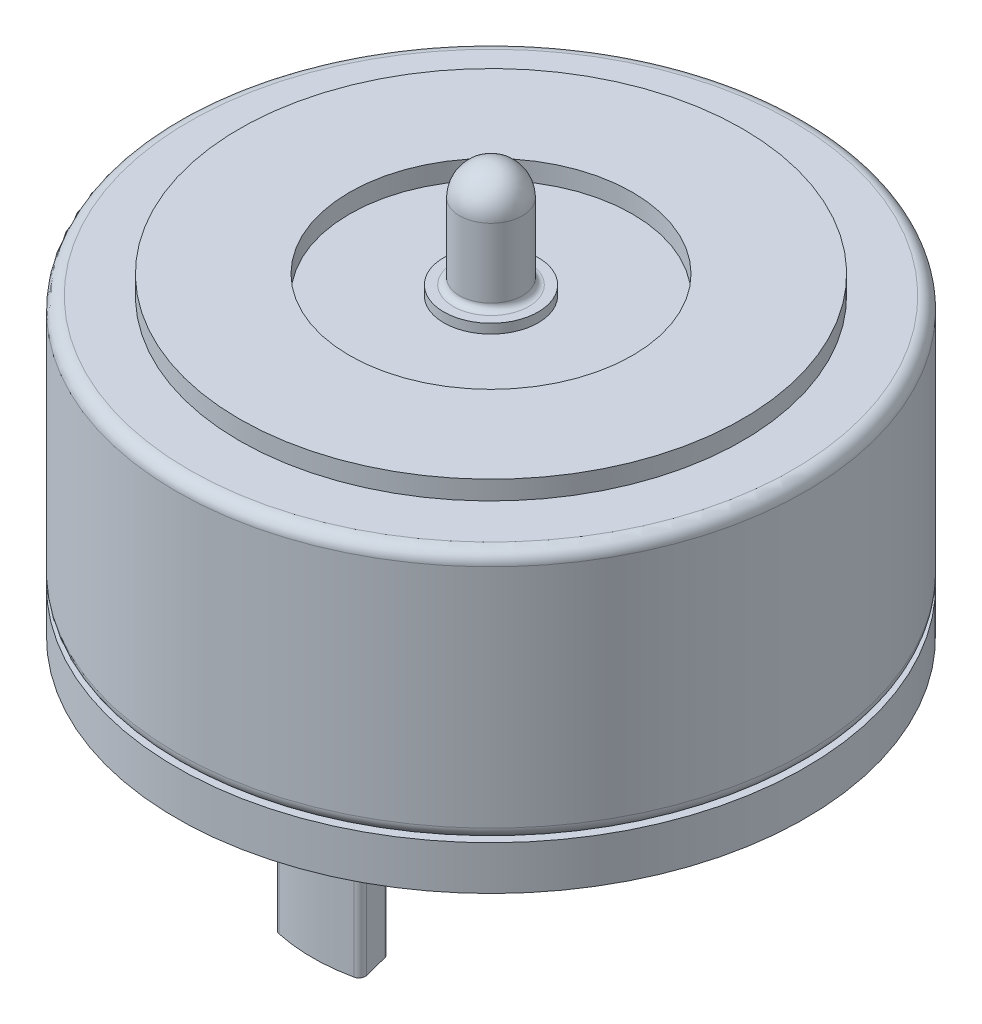
ISO-10303-21;
HEADER;
FILE_DESCRIPTION(('STEP AP214'),'2;1');
FILE_NAME('part.step','',(''),(''),'','','');
FILE_SCHEMA(('AUTOMOTIVE_DESIGN { 1 0 10303 214 1 1 1 1 }'));
ENDSEC;
DATA;
#1=APPLICATION_CONTEXT('core data for automotive mechanical design processes');
#2=APPLICATION_PROTOCOL_DEFINITION('international standard','automotive_design',2000,#1);
#3=PRODUCT_CONTEXT('',#1,'mechanical');
#4=PRODUCT('Part','Part','',(#3));
#5=PRODUCT_RELATED_PRODUCT_CATEGORY('part','',(#4));
#6=PRODUCT_DEFINITION_FORMATION('','',#4);
#7=PRODUCT_DEFINITION_CONTEXT('part definition',#1,'design');
#8=PRODUCT_DEFINITION('design','',#6,#7);
#9=PRODUCT_DEFINITION_SHAPE('','',#8);
#10=(LENGTH_UNIT() NAMED_UNIT(*) SI_UNIT(.MILLI.,.METRE.));
#11=(NAMED_UNIT(*) PLANE_ANGLE_UNIT() SI_UNIT($,.RADIAN.));
#12=(NAMED_UNIT(*) SI_UNIT($,.STERADIAN.) SOLID_ANGLE_UNIT());
#13=UNCERTAINTY_MEASURE_WITH_UNIT(LENGTH_MEASURE(1.E-05),#10,'distance_accuracy_value','');
#14=(GEOMETRIC_REPRESENTATION_CONTEXT(3) GLOBAL_UNCERTAINTY_ASSIGNED_CONTEXT((#13)) GLOBAL_UNIT_ASSIGNED_CONTEXT((#10,
#11,#12)) REPRESENTATION_CONTEXT('',''));
#15=CARTESIAN_POINT('',(0.,0.,0.));
#16=DIRECTION('',(0.,0.,1.));
#17=DIRECTION('',(1.,0.,0.));
#18=AXIS2_PLACEMENT_3D('',#15,#16,#17);
#19=CARTESIAN_POINT('',(0.,-0.7,0.));
#20=DIRECTION('',(0.,-1.,0.));
#21=DIRECTION('',(0.,0.,-1.));
#22=AXIS2_PLACEMENT_3D('',#19,#20,#21);
#23=PLANE('',#22);
#24=CARTESIAN_POINT('',(0.,-0.7,0.));
#25=DIRECTION('',(0.,-1.,0.));
#26=DIRECTION('',(0.,0.,-1.));
#27=AXIS2_PLACEMENT_3D('',#24,#25,#26);
#28=CIRCLE('',#27,0.3);
#29=CARTESIAN_POINT('',(0.,-0.7,-0.3));
#30=VERTEX_POINT('',#29);
#31=EDGE_CURVE('E459',#30,#30,#28,.T.);
#32=ORIENTED_EDGE('',*,*,#31,.F.);
#33=EDGE_LOOP('',(#32));
#34=FACE_BOUND('',#33,.T.);
#35=CARTESIAN_POINT('',(0.,-0.7,0.));
#36=DIRECTION('',(0.,-1.,0.));
#37=DIRECTION('',(0.,0.,-1.));
#38=AXIS2_PLACEMENT_3D('',#35,#36,#37);
#39=CIRCLE('',#38,5.);
#40=CARTESIAN_POINT('',(0.,-0.7,-5.));
#41=VERTEX_POINT('',#40);
#42=EDGE_CURVE('E217',#41,#41,#39,.T.);
#43=ORIENTED_EDGE('',*,*,#42,.T.);
#44=EDGE_LOOP('',(#43));
#45=FACE_BOUND('',#44,.T.);
#46=DIRECTION('',(0.246478873239437,0.,-0.969148164651111));
#47=VECTOR('',#46,1.);
#48=CARTESIAN_POINT('',(-0.7,-0.7,2.75238078760916));
#49=LINE('',#48,#47);
#50=CARTESIAN_POINT('',(-0.674902183835909,-0.7,2.65369686329345));
#51=VERTEX_POINT('',#50);
#52=CARTESIAN_POINT('',(-0.576233658441787,-0.7,2.26573492952702));
#53=VERTEX_POINT('',#52);
#54=EDGE_CURVE('E209',#51,#53,#49,.T.);
#55=ORIENTED_EDGE('',*,*,#54,.F.);
#56=CARTESIAN_POINT('',(-0.577987367370798,-0.7,2.6783447506174));
#57=DIRECTION('',(0.,-1.,0.));
#58=DIRECTION('',(0.,0.,-1.));
#59=AXIS2_PLACEMENT_3D('',#56,#57,#58);
#60=CIRCLE('',#59,0.1);
#61=CARTESIAN_POINT('',(-0.599081796836886,-0.7,2.77609455903409));
#62=VERTEX_POINT('',#61);
#63=EDGE_CURVE('E49',#51,#62,#60,.F.);
#64=ORIENTED_EDGE('',*,*,#63,.T.);
#65=CARTESIAN_POINT('',(0.,-0.7,0.));
#66=DIRECTION('',(0.,-1.,0.));
#67=DIRECTION('',(0.,0.,-1.));
#68=AXIS2_PLACEMENT_3D('',#65,#66,#67);
#69=CIRCLE('',#68,2.84);
#70=CARTESIAN_POINT('',(0.599081796836885,-0.7,2.77609455903409));
#71=VERTEX_POINT('',#70);
#72=EDGE_CURVE('E206',#71,#62,#69,.T.);
#73=ORIENTED_EDGE('',*,*,#72,.F.);
#74=CARTESIAN_POINT('',(0.577987367370797,-0.7,2.6783447506174));
#75=DIRECTION('',(0.,-1.,0.));
#76=DIRECTION('',(0.,0.,-1.));
#77=AXIS2_PLACEMENT_3D('',#74,#75,#76);
#78=CIRCLE('',#77,0.1);
#79=CARTESIAN_POINT('',(0.674902183835909,-0.7,2.65369686329345));
#80=VERTEX_POINT('',#79);
#81=EDGE_CURVE('E313',#71,#80,#78,.F.);
#82=ORIENTED_EDGE('',*,*,#81,.T.);
#83=DIRECTION('',(0.246478873239436,0.,0.969148164651111));
#84=VECTOR('',#83,1.);
#85=CARTESIAN_POINT('',(0.7,-0.7,2.75238078760916));
#86=LINE('',#85,#84);
#87=CARTESIAN_POINT('',(0.576233658441787,-0.7,2.26573492952702));
#88=VERTEX_POINT('',#87);
#89=EDGE_CURVE('E196',#88,#80,#86,.T.);
#90=ORIENTED_EDGE('',*,*,#89,.F.);
#91=CARTESIAN_POINT('',(0.479318841976676,-0.7,2.29038281685096));
#92=DIRECTION('',(0.,-1.,0.));
#93=DIRECTION('',(0.,0.,-1.));
#94=AXIS2_PLACEMENT_3D('',#91,#92,#93);
#95=CIRCLE('',#94,0.1);
#96=CARTESIAN_POINT('',(0.458835130781091,-0.7,2.19250320929323));
#97=VERTEX_POINT('',#96);
#98=EDGE_CURVE('E315',#88,#97,#95,.F.);
#99=ORIENTED_EDGE('',*,*,#98,.T.);
#100=CARTESIAN_POINT('',(0.,-0.7,0.));
#101=DIRECTION('',(0.,1.,0.));
#102=DIRECTION('',(0.,0.,-1.));
#103=AXIS2_PLACEMENT_3D('',#100,#101,#102);
#104=CIRCLE('',#103,2.24);
#105=CARTESIAN_POINT('',(-0.458835130781092,-0.7,2.19250320929323));
#106=VERTEX_POINT('',#105);
#107=EDGE_CURVE('E212',#106,#97,#104,.T.);
#108=ORIENTED_EDGE('',*,*,#107,.F.);
#109=CARTESIAN_POINT('',(-0.479318841976676,-0.7,2.29038281685096));
#110=DIRECTION('',(0.,-1.,0.));
#111=DIRECTION('',(0.,0.,-1.));
#112=AXIS2_PLACEMENT_3D('',#109,#110,#111);
#113=CIRCLE('',#112,0.1);
#114=EDGE_CURVE('E12',#106,#53,#113,.F.);
#115=ORIENTED_EDGE('',*,*,#114,.T.);
#116=EDGE_LOOP('',(#55,#64,#73,#82,#90,#99,#108,#115));
#117=FACE_BOUND('',#116,.T.);
#118=DIRECTION('',(-0.246478873239437,0.,0.969148164651111));
#119=VECTOR('',#118,1.);
#120=CARTESIAN_POINT('',(0.552112676056338,-0.7,-2.17089188881849));
#121=LINE('',#120,#119);
#122=CARTESIAN_POINT('',(0.674902183835909,-0.7,-2.65369686329345));
#123=VERTEX_POINT('',#122);
#124=CARTESIAN_POINT('',(0.576233658441787,-0.7,-2.26573492952702));
#125=VERTEX_POINT('',#124);
#126=EDGE_CURVE('E170',#123,#125,#121,.T.);
#127=ORIENTED_EDGE('',*,*,#126,.F.);
#128=CARTESIAN_POINT('',(0.577987367370798,-0.7,-2.6783447506174));
#129=DIRECTION('',(0.,-1.,0.));
#130=DIRECTION('',(0.,0.,-1.));
#131=AXIS2_PLACEMENT_3D('',#128,#129,#130);
#132=CIRCLE('',#131,0.1);
#133=CARTESIAN_POINT('',(0.599081796836885,-0.7,-2.77609455903409));
#134=VERTEX_POINT('',#133);
#135=EDGE_CURVE('E153',#123,#134,#132,.F.);
#136=ORIENTED_EDGE('',*,*,#135,.T.);
#137=CARTESIAN_POINT('',(0.,-0.7,0.));
#138=DIRECTION('',(0.,-1.,0.));
#139=DIRECTION('',(0.,0.,-1.));
#140=AXIS2_PLACEMENT_3D('',#137,#138,#139);
#141=CIRCLE('',#140,2.84);
#142=CARTESIAN_POINT('',(-0.599081796836885,-0.7,-2.77609455903409));
#143=VERTEX_POINT('',#142);
#144=EDGE_CURVE('E180',#143,#134,#141,.T.);
#145=ORIENTED_EDGE('',*,*,#144,.F.);
#146=CARTESIAN_POINT('',(-0.577987367370797,-0.7,-2.6783447506174));
#147=DIRECTION('',(0.,-1.,0.));
#148=DIRECTION('',(0.,0.,-1.));
#149=AXIS2_PLACEMENT_3D('',#146,#147,#148);
#150=CIRCLE('',#149,0.1);
#151=CARTESIAN_POINT('',(-0.674902183835908,-0.7,-2.65369686329346));
#152=VERTEX_POINT('',#151);
#153=EDGE_CURVE('E163',#143,#152,#150,.F.);
#154=ORIENTED_EDGE('',*,*,#153,.T.);
#155=DIRECTION('',(-0.246478873239436,0.,-0.969148164651112));
#156=VECTOR('',#155,1.);
#157=CARTESIAN_POINT('',(-0.552112676056337,-0.7,-2.17089188881849));
#158=LINE('',#157,#156);
#159=CARTESIAN_POINT('',(-0.576233658441786,-0.7,-2.26573492952702));
#160=VERTEX_POINT('',#159);
#161=EDGE_CURVE('E183',#160,#152,#158,.T.);
#162=ORIENTED_EDGE('',*,*,#161,.F.);
#163=CARTESIAN_POINT('',(-0.479318841976675,-0.7,-2.29038281685096));
#164=DIRECTION('',(0.,-1.,0.));
#165=DIRECTION('',(0.,0.,-1.));
#166=AXIS2_PLACEMENT_3D('',#163,#164,#165);
#167=CIRCLE('',#166,0.1);
#168=CARTESIAN_POINT('',(-0.458835130781091,-0.7,-2.19250320929323));
#169=VERTEX_POINT('',#168);
#170=EDGE_CURVE('E310',#160,#169,#167,.F.);
#171=ORIENTED_EDGE('',*,*,#170,.T.);
#172=CARTESIAN_POINT('',(0.,-0.7,0.));
#173=DIRECTION('',(0.,1.,0.));
#174=DIRECTION('',(0.,0.,-1.));
#175=AXIS2_PLACEMENT_3D('',#172,#173,#174);
#176=CIRCLE('',#175,2.24);
#177=CARTESIAN_POINT('',(0.458835130781091,-0.7,-2.19250320929323));
#178=VERTEX_POINT('',#177);
#179=EDGE_CURVE('E179',#178,#169,#176,.T.);
#180=ORIENTED_EDGE('',*,*,#179,.F.);
#181=CARTESIAN_POINT('',(0.479318841976676,-0.7,-2.29038281685096));
#182=DIRECTION('',(0.,-1.,0.));
#183=DIRECTION('',(0.,0.,-1.));
#184=AXIS2_PLACEMENT_3D('',#181,#182,#183);
#185=CIRCLE('',#184,0.1);
#186=EDGE_CURVE('E178',#178,#125,#185,.F.);
#187=ORIENTED_EDGE('',*,*,#186,.T.);
#188=EDGE_LOOP('',(#127,#136,#145,#154,#162,#171,#180,#187));
#189=FACE_BOUND('',#188,.T.);
#190=ADVANCED_FACE('F41',(#34,#45,#117,#189),#23,.T.);
#191=CARTESIAN_POINT('',(0.,4.3,0.));
#192=DIRECTION('',(0.,-1.,0.));
#193=DIRECTION('',(0.,0.,-1.));
#194=AXIS2_PLACEMENT_3D('',#191,#192,#193);
#195=CYLINDRICAL_SURFACE('',#194,5.);
#196=CARTESIAN_POINT('',(0.,0.2,0.));
#197=DIRECTION('',(0.,1.,0.));
#198=DIRECTION('',(0.,0.,1.));
#199=AXIS2_PLACEMENT_3D('',#196,#197,#198);
#200=CIRCLE('',#199,5.);
#201=CARTESIAN_POINT('',(0.,0.2,5.));
#202=VERTEX_POINT('',#201);
#203=EDGE_CURVE('E246',#202,#202,#200,.T.);
#204=ORIENTED_EDGE('',*,*,#203,.T.);
#205=EDGE_LOOP('',(#204));
#206=FACE_BOUND('',#205,.T.);
#207=CARTESIAN_POINT('',(0.,3.8,0.));
#208=DIRECTION('',(0.,1.,0.));
#209=DIRECTION('',(0.,0.,1.));
#210=AXIS2_PLACEMENT_3D('',#207,#208,#209);
#211=CIRCLE('',#210,5.);
#212=CARTESIAN_POINT('',(0.,3.8,5.));
#213=VERTEX_POINT('',#212);
#214=EDGE_CURVE('E243',#213,#213,#211,.F.);
#215=ORIENTED_EDGE('',*,*,#214,.T.);
#216=EDGE_LOOP('',(#215));
#217=FACE_BOUND('',#216,.T.);
#218=ADVANCED_FACE('F360',(#206,#217),#195,.T.);
#219=CARTESIAN_POINT('',(0.,4.,0.));
#220=DIRECTION('',(0.,1.,0.));
#221=DIRECTION('',(0.,0.,1.));
#222=AXIS2_PLACEMENT_3D('',#219,#220,#221);
#223=CYLINDRICAL_SURFACE('',#222,4.);
#224=CARTESIAN_POINT('',(0.,4.,0.));
#225=DIRECTION('',(0.,1.,0.));
#226=DIRECTION('',(0.,0.,1.));
#227=AXIS2_PLACEMENT_3D('',#224,#225,#226);
#228=CIRCLE('',#227,4.);
#229=CARTESIAN_POINT('',(0.,4.,4.));
#230=VERTEX_POINT('',#229);
#231=EDGE_CURVE('E235',#230,#230,#228,.T.);
#232=ORIENTED_EDGE('',*,*,#231,.T.);
#233=EDGE_LOOP('',(#232));
#234=FACE_BOUND('',#233,.T.);
#235=CARTESIAN_POINT('',(0.,4.3,0.));
#236=DIRECTION('',(0.,1.,0.));
#237=DIRECTION('',(0.,0.,1.));
#238=AXIS2_PLACEMENT_3D('',#235,#236,#237);
#239=CIRCLE('',#238,4.);
#240=CARTESIAN_POINT('',(0.,4.3,4.));
#241=VERTEX_POINT('',#240);
#242=EDGE_CURVE('E232',#241,#241,#239,.T.);
#243=ORIENTED_EDGE('',*,*,#242,.F.);
#244=EDGE_LOOP('',(#243));
#245=FACE_BOUND('',#244,.T.);
#246=ADVANCED_FACE('F366',(#234,#245),#223,.T.);
#247=CARTESIAN_POINT('',(0.,4.,0.));
#248=DIRECTION('',(0.,1.,0.));
#249=DIRECTION('',(0.,0.,1.));
#250=AXIS2_PLACEMENT_3D('',#247,#248,#249);
#251=PLANE('',#250);
#252=CARTESIAN_POINT('',(0.,4.,0.));
#253=DIRECTION('',(0.,1.,0.));
#254=DIRECTION('',(0.,0.,1.));
#255=AXIS2_PLACEMENT_3D('',#252,#253,#254);
#256=CIRCLE('',#255,4.8);
#257=CARTESIAN_POINT('',(0.,4.,4.8));
#258=VERTEX_POINT('',#257);
#259=EDGE_CURVE('E252',#258,#258,#256,.T.);
#260=ORIENTED_EDGE('',*,*,#259,.T.);
#261=EDGE_LOOP('',(#260));
#262=FACE_BOUND('',#261,.T.);
#263=ORIENTED_EDGE('',*,*,#231,.F.);
#264=EDGE_LOOP('',(#263));
#265=FACE_BOUND('',#264,.T.);
#266=ADVANCED_FACE('F405',(#262,#265),#251,.T.);
#267=CARTESIAN_POINT('',(0.,4.3,0.));
#268=DIRECTION('',(0.,1.,0.));
#269=DIRECTION('',(0.,0.,1.));
#270=AXIS2_PLACEMENT_3D('',#267,#268,#269);
#271=PLANE('',#270);
#272=CARTESIAN_POINT('',(0.,4.3,0.));
#273=DIRECTION('',(0.,1.,0.));
#274=DIRECTION('',(0.,0.,1.));
#275=AXIS2_PLACEMENT_3D('',#272,#273,#274);
#276=CIRCLE('',#275,2.25);
#277=CARTESIAN_POINT('',(0.,4.3,2.25));
#278=VERTEX_POINT('',#277);
#279=EDGE_CURVE('E226',#278,#278,#276,.T.);
#280=ORIENTED_EDGE('',*,*,#279,.F.);
#281=EDGE_LOOP('',(#280));
#282=FACE_BOUND('',#281,.T.);
#283=ORIENTED_EDGE('',*,*,#242,.T.);
#284=EDGE_LOOP('',(#283));
#285=FACE_BOUND('',#284,.T.);
#286=ADVANCED_FACE('F403',(#282,#285),#271,.T.);
#287=CARTESIAN_POINT('',(0.,4.,0.));
#288=DIRECTION('',(0.,1.,0.));
#289=DIRECTION('',(0.,0.,1.));
#290=AXIS2_PLACEMENT_3D('',#287,#288,#289);
#291=CYLINDRICAL_SURFACE('',#290,2.25);
#292=CARTESIAN_POINT('',(0.,4.,0.));
#293=DIRECTION('',(0.,1.,0.));
#294=DIRECTION('',(0.,0.,1.));
#295=AXIS2_PLACEMENT_3D('',#292,#293,#294);
#296=CIRCLE('',#295,2.25);
#297=CARTESIAN_POINT('',(0.,4.,2.25));
#298=VERTEX_POINT('',#297);
#299=EDGE_CURVE('E229',#298,#298,#296,.T.);
#300=ORIENTED_EDGE('',*,*,#299,.F.);
#301=EDGE_LOOP('',(#300));
#302=FACE_BOUND('',#301,.T.);
#303=ORIENTED_EDGE('',*,*,#279,.T.);
#304=EDGE_LOOP('',(#303));
#305=FACE_BOUND('',#304,.T.);
#306=ADVANCED_FACE('F399',(#302,#305),#291,.F.);
#307=CARTESIAN_POINT('',(0.,4.,0.));
#308=DIRECTION('',(0.,1.,0.));
#309=DIRECTION('',(0.,0.,1.));
#310=AXIS2_PLACEMENT_3D('',#307,#308,#309);
#311=PLANE('',#310);
#312=CARTESIAN_POINT('',(0.,4.,0.));
#313=DIRECTION('',(0.,1.,0.));
#314=DIRECTION('',(0.,0.,1.));
#315=AXIS2_PLACEMENT_3D('',#312,#313,#314);
#316=CIRCLE('',#315,0.75);
#317=CARTESIAN_POINT('',(0.,4.,0.75));
#318=VERTEX_POINT('',#317);
#319=EDGE_CURVE('E220',#318,#318,#316,.T.);
#320=ORIENTED_EDGE('',*,*,#319,.F.);
#321=EDGE_LOOP('',(#320));
#322=FACE_BOUND('',#321,.T.);
#323=ORIENTED_EDGE('',*,*,#299,.T.);
#324=EDGE_LOOP('',(#323));
#325=FACE_BOUND('',#324,.T.);
#326=ADVANCED_FACE('F395',(#322,#325),#311,.T.);
#327=CARTESIAN_POINT('',(0.,4.15,0.));
#328=DIRECTION('',(0.,-1.,0.));
#329=DIRECTION('',(0.,0.,-1.));
#330=AXIS2_PLACEMENT_3D('',#327,#328,#329);
#331=CYLINDRICAL_SURFACE('',#330,0.75);
#332=CARTESIAN_POINT('',(0.,4.15,0.));
#333=DIRECTION('',(0.,1.,0.));
#334=DIRECTION('',(0.,0.,1.));
#335=AXIS2_PLACEMENT_3D('',#332,#333,#334);
#336=CIRCLE('',#335,0.75);
#337=CARTESIAN_POINT('',(0.,4.15,0.75));
#338=VERTEX_POINT('',#337);
#339=EDGE_CURVE('E223',#338,#338,#336,.T.);
#340=ORIENTED_EDGE('',*,*,#339,.F.);
#341=EDGE_LOOP('',(#340));
#342=FACE_BOUND('',#341,.T.);
#343=ORIENTED_EDGE('',*,*,#319,.T.);
#344=EDGE_LOOP('',(#343));
#345=FACE_BOUND('',#344,.T.);
#346=ADVANCED_FACE('F391',(#342,#345),#331,.T.);
#347=CARTESIAN_POINT('',(0.,4.15,0.));
#348=DIRECTION('',(0.,1.,0.));
#349=DIRECTION('',(0.,0.,1.));
#350=AXIS2_PLACEMENT_3D('',#347,#348,#349);
#351=PLANE('',#350);
#352=CARTESIAN_POINT('',(0.,4.15,0.));
#353=DIRECTION('',(0.,1.,0.));
#354=DIRECTION('',(0.,0.,1.));
#355=AXIS2_PLACEMENT_3D('',#352,#353,#354);
#356=CIRCLE('',#355,0.6);
#357=CARTESIAN_POINT('',(0.,4.15,0.6));
#358=VERTEX_POINT('',#357);
#359=EDGE_CURVE('E258',#358,#358,#356,.F.);
#360=ORIENTED_EDGE('',*,*,#359,.T.);
#361=EDGE_LOOP('',(#360));
#362=FACE_BOUND('',#361,.T.);
#363=ORIENTED_EDGE('',*,*,#339,.T.);
#364=EDGE_LOOP('',(#363));
#365=FACE_BOUND('',#364,.T.);
#366=ADVANCED_FACE('F387',(#362,#365),#351,.T.);
#367=CARTESIAN_POINT('',(0.,5.85,0.));
#368=DIRECTION('',(0.,-1.,0.));
#369=DIRECTION('',(0.,0.,-1.));
#370=AXIS2_PLACEMENT_3D('',#367,#368,#369);
#371=CYLINDRICAL_SURFACE('',#370,0.5);
#372=CARTESIAN_POINT('',(0.,4.25,0.));
#373=DIRECTION('',(0.,1.,0.));
#374=DIRECTION('',(0.,0.,1.));
#375=AXIS2_PLACEMENT_3D('',#372,#373,#374);
#376=CIRCLE('',#375,0.5);
#377=CARTESIAN_POINT('',(0.,4.25,0.5));
#378=VERTEX_POINT('',#377);
#379=EDGE_CURVE('E255',#378,#378,#376,.T.);
#380=ORIENTED_EDGE('',*,*,#379,.T.);
#381=EDGE_LOOP('',(#380));
#382=FACE_BOUND('',#381,.T.);
#383=CARTESIAN_POINT('',(0.,5.35,0.));
#384=DIRECTION('',(0.,-1.,0.));
#385=DIRECTION('',(0.,0.,-1.));
#386=AXIS2_PLACEMENT_3D('',#383,#384,#385);
#387=CIRCLE('',#386,0.5);
#388=CARTESIAN_POINT('',(0.,5.35,-0.5));
#389=VERTEX_POINT('',#388);
#390=EDGE_CURVE('E238',#389,#389,#387,.T.);
#391=ORIENTED_EDGE('',*,*,#390,.T.);
#392=EDGE_LOOP('',(#391));
#393=FACE_BOUND('',#392,.T.);
#394=ADVANCED_FACE('F383',(#382,#393),#371,.T.);
#395=CARTESIAN_POINT('',(0.,5.35,0.));
#396=DIRECTION('',(0.,1.,0.));
#397=DIRECTION('',(0.,0.,1.));
#398=AXIS2_PLACEMENT_3D('',#395,#396,#397);
#399=SPHERICAL_SURFACE('',#398,0.5);
#400=ORIENTED_EDGE('',*,*,#390,.F.);
#401=EDGE_LOOP('',(#400));
#402=FACE_BOUND('',#401,.T.);
#403=ADVANCED_FACE('F386',(#402),#399,.T.);
#404=CARTESIAN_POINT('',(0.,0.2,0.));
#405=DIRECTION('',(0.,1.,0.));
#406=DIRECTION('',(0.,0.,1.));
#407=AXIS2_PLACEMENT_3D('',#404,#405,#406);
#408=TOROIDAL_SURFACE('',#407,4.8,0.2);
#409=CARTESIAN_POINT('',(0.,0.,0.));
#410=DIRECTION('',(0.,1.,0.));
#411=DIRECTION('',(0.,0.,1.));
#412=AXIS2_PLACEMENT_3D('',#409,#410,#411);
#413=CIRCLE('',#412,4.8);
#414=CARTESIAN_POINT('',(0.,0.,4.8));
#415=VERTEX_POINT('',#414);
#416=EDGE_CURVE('E249',#415,#415,#413,.F.);
#417=ORIENTED_EDGE('',*,*,#416,.F.);
#418=EDGE_LOOP('',(#417));
#419=FACE_BOUND('',#418,.T.);
#420=ORIENTED_EDGE('',*,*,#203,.F.);
#421=EDGE_LOOP('',(#420));
#422=FACE_BOUND('',#421,.T.);
#423=ADVANCED_FACE('F417',(#419,#422),#408,.T.);
#424=CARTESIAN_POINT('',(0.,3.8,0.));
#425=DIRECTION('',(0.,1.,0.));
#426=DIRECTION('',(0.,0.,1.));
#427=AXIS2_PLACEMENT_3D('',#424,#425,#426);
#428=TOROIDAL_SURFACE('',#427,4.8,0.2);
#429=ORIENTED_EDGE('',*,*,#214,.F.);
#430=EDGE_LOOP('',(#429));
#431=FACE_BOUND('',#430,.T.);
#432=ORIENTED_EDGE('',*,*,#259,.F.);
#433=EDGE_LOOP('',(#432));
#434=FACE_BOUND('',#433,.T.);
#435=ADVANCED_FACE('F421',(#431,#434),#428,.T.);
#436=CARTESIAN_POINT('',(0.,4.25,0.));
#437=DIRECTION('',(0.,1.,0.));
#438=DIRECTION('',(0.,0.,1.));
#439=AXIS2_PLACEMENT_3D('',#436,#437,#438);
#440=TOROIDAL_SURFACE('',#439,0.6,0.1);
#441=ORIENTED_EDGE('',*,*,#359,.F.);
#442=EDGE_LOOP('',(#441));
#443=FACE_BOUND('',#442,.T.);
#444=ORIENTED_EDGE('',*,*,#379,.F.);
#445=EDGE_LOOP('',(#444));
#446=FACE_BOUND('',#445,.T.);
#447=ADVANCED_FACE('F381',(#443,#446),#440,.F.);
#448=CARTESIAN_POINT('',(0.,-0.7,0.));
#449=DIRECTION('',(0.,1.,0.));
#450=DIRECTION('',(0.,0.,1.));
#451=AXIS2_PLACEMENT_3D('',#448,#449,#450);
#452=CYLINDRICAL_SURFACE('',#451,5.);
#453=ORIENTED_EDGE('',*,*,#42,.F.);
#454=EDGE_LOOP('',(#453));
#455=FACE_BOUND('',#454,.T.);
#456=CARTESIAN_POINT('',(0.,0.,0.));
#457=DIRECTION('',(0.,-1.,0.));
#458=DIRECTION('',(0.,0.,-1.));
#459=AXIS2_PLACEMENT_3D('',#456,#457,#458);
#460=CIRCLE('',#459,5.);
#461=CARTESIAN_POINT('',(0.,0.,-5.));
#462=VERTEX_POINT('',#461);
#463=EDGE_CURVE('E205',#462,#462,#460,.T.);
#464=ORIENTED_EDGE('',*,*,#463,.T.);
#465=EDGE_LOOP('',(#464));
#466=FACE_BOUND('',#465,.T.);
#467=ADVANCED_FACE('F377',(#455,#466),#452,.T.);
#468=CARTESIAN_POINT('',(0.,0.,0.));
#469=DIRECTION('',(0.,-1.,0.));
#470=DIRECTION('',(0.,0.,-1.));
#471=AXIS2_PLACEMENT_3D('',#468,#469,#470);
#472=PLANE('',#471);
#473=ORIENTED_EDGE('',*,*,#416,.T.);
#474=EDGE_LOOP('',(#473));
#475=FACE_BOUND('',#474,.T.);
#476=ORIENTED_EDGE('',*,*,#463,.F.);
#477=EDGE_LOOP('',(#476));
#478=FACE_BOUND('',#477,.T.);
#479=ADVANCED_FACE('F374',(#475,#478),#472,.F.);
#480=CARTESIAN_POINT('',(0.,-3.7,0.));
#481=DIRECTION('',(0.,1.,0.));
#482=DIRECTION('',(0.,0.,1.));
#483=AXIS2_PLACEMENT_3D('',#480,#481,#482);
#484=CYLINDRICAL_SURFACE('',#483,2.84);
#485=CARTESIAN_POINT('',(0.,-3.7,0.));
#486=DIRECTION('',(0.,-1.,0.));
#487=DIRECTION('',(0.,0.,-1.));
#488=AXIS2_PLACEMENT_3D('',#485,#486,#487);
#489=CIRCLE('',#488,2.84);
#490=CARTESIAN_POINT('',(0.599081796836885,-3.7,2.77609455903409));
#491=VERTEX_POINT('',#490);
#492=CARTESIAN_POINT('',(-0.599081796836886,-3.7,2.77609455903409));
#493=VERTEX_POINT('',#492);
#494=EDGE_CURVE('E192',#491,#493,#489,.T.);
#495=ORIENTED_EDGE('',*,*,#494,.F.);
#496=DIRECTION('',(0.,1.,0.));
#497=VECTOR('',#496,1.);
#498=CARTESIAN_POINT('',(0.599081796836885,-3.7,2.77609455903409));
#499=LINE('',#498,#497);
#500=EDGE_CURVE('E285',#491,#71,#499,.T.);
#501=ORIENTED_EDGE('',*,*,#500,.T.);
#502=ORIENTED_EDGE('',*,*,#72,.T.);
#503=DIRECTION('',(0.,1.,0.));
#504=VECTOR('',#503,1.);
#505=CARTESIAN_POINT('',(-0.599081796836886,-3.7,2.77609455903409));
#506=LINE('',#505,#504);
#507=EDGE_CURVE('E283',#62,#493,#506,.F.);
#508=ORIENTED_EDGE('',*,*,#507,.T.);
#509=EDGE_LOOP('',(#495,#501,#502,#508));
#510=FACE_BOUND('',#509,.T.);
#511=ADVANCED_FACE('F319',(#510),#484,.T.);
#512=CARTESIAN_POINT('',(-0.7,-3.7,2.75238078760916));
#513=DIRECTION('',(0.969148164651111,0.,0.246478873239437));
#514=DIRECTION('',(0.246478873239437,0.,-0.969148164651111));
#515=AXIS2_PLACEMENT_3D('',#512,#513,#514);
#516=PLANE('',#515);
#517=DIRECTION('',(0.246478873239437,0.,-0.969148164651111));
#518=VECTOR('',#517,1.);
#519=CARTESIAN_POINT('',(-0.7,-3.7,2.75238078760916));
#520=LINE('',#519,#518);
#521=CARTESIAN_POINT('',(-0.674902183835909,-3.7,2.65369686329345));
#522=VERTEX_POINT('',#521);
#523=CARTESIAN_POINT('',(-0.576233658441787,-3.7,2.26573492952702));
#524=VERTEX_POINT('',#523);
#525=EDGE_CURVE('E195',#522,#524,#520,.T.);
#526=ORIENTED_EDGE('',*,*,#525,.F.);
#527=DIRECTION('',(0.,1.,0.));
#528=VECTOR('',#527,1.);
#529=CARTESIAN_POINT('',(-0.674902183835909,-3.7,2.65369686329345));
#530=LINE('',#529,#528);
#531=EDGE_CURVE('E164',#522,#51,#530,.T.);
#532=ORIENTED_EDGE('',*,*,#531,.T.);
#533=ORIENTED_EDGE('',*,*,#54,.T.);
#534=DIRECTION('',(0.,1.,0.));
#535=VECTOR('',#534,1.);
#536=CARTESIAN_POINT('',(-0.576233658441787,-3.7,2.26573492952702));
#537=LINE('',#536,#535);
#538=EDGE_CURVE('E306',#53,#524,#537,.F.);
#539=ORIENTED_EDGE('',*,*,#538,.T.);
#540=EDGE_LOOP('',(#526,#532,#533,#539));
#541=FACE_BOUND('',#540,.T.);
#542=ADVANCED_FACE('F328',(#541),#516,.F.);
#543=CARTESIAN_POINT('',(0.,-3.7,0.));
#544=DIRECTION('',(0.,1.,0.));
#545=DIRECTION('',(0.,0.,1.));
#546=AXIS2_PLACEMENT_3D('',#543,#544,#545);
#547=CYLINDRICAL_SURFACE('',#546,2.24);
#548=ORIENTED_EDGE('',*,*,#107,.T.);
#549=DIRECTION('',(0.,1.,0.));
#550=VECTOR('',#549,1.);
#551=CARTESIAN_POINT('',(0.458835130781091,-3.7,2.19250320929323));
#552=LINE('',#551,#550);
#553=CARTESIAN_POINT('',(0.458835130781091,-3.7,2.19250320929323));
#554=VERTEX_POINT('',#553);
#555=EDGE_CURVE('E304',#97,#554,#552,.F.);
#556=ORIENTED_EDGE('',*,*,#555,.T.);
#557=CARTESIAN_POINT('',(0.,-3.7,0.));
#558=DIRECTION('',(0.,1.,0.));
#559=DIRECTION('',(0.,0.,-1.));
#560=AXIS2_PLACEMENT_3D('',#557,#558,#559);
#561=CIRCLE('',#560,2.24);
#562=CARTESIAN_POINT('',(-0.458835130781092,-3.7,2.19250320929323));
#563=VERTEX_POINT('',#562);
#564=EDGE_CURVE('E199',#563,#554,#561,.T.);
#565=ORIENTED_EDGE('',*,*,#564,.F.);
#566=DIRECTION('',(0.,1.,0.));
#567=VECTOR('',#566,1.);
#568=CARTESIAN_POINT('',(-0.458835130781092,-3.7,2.19250320929323));
#569=LINE('',#568,#567);
#570=EDGE_CURVE('E301',#563,#106,#569,.T.);
#571=ORIENTED_EDGE('',*,*,#570,.T.);
#572=EDGE_LOOP('',(#548,#556,#565,#571));
#573=FACE_BOUND('',#572,.T.);
#574=ADVANCED_FACE('F335',(#573),#547,.F.);
#575=CARTESIAN_POINT('',(0.7,-3.7,2.75238078760916));
#576=DIRECTION('',(-0.969148164651111,0.,0.246478873239436));
#577=DIRECTION('',(0.246478873239436,0.,0.969148164651111));
#578=AXIS2_PLACEMENT_3D('',#575,#576,#577);
#579=PLANE('',#578);
#580=ORIENTED_EDGE('',*,*,#89,.T.);
#581=DIRECTION('',(0.,1.,0.));
#582=VECTOR('',#581,1.);
#583=CARTESIAN_POINT('',(0.674902183835909,-3.7,2.65369686329345));
#584=LINE('',#583,#582);
#585=CARTESIAN_POINT('',(0.674902183835909,-3.7,2.65369686329345));
#586=VERTEX_POINT('',#585);
#587=EDGE_CURVE('E291',#80,#586,#584,.F.);
#588=ORIENTED_EDGE('',*,*,#587,.T.);
#589=DIRECTION('',(0.246478873239436,0.,0.969148164651111));
#590=VECTOR('',#589,1.);
#591=CARTESIAN_POINT('',(0.7,-3.7,2.75238078760916));
#592=LINE('',#591,#590);
#593=CARTESIAN_POINT('',(0.576233658441787,-3.7,2.26573492952702));
#594=VERTEX_POINT('',#593);
#595=EDGE_CURVE('E202',#594,#586,#592,.T.);
#596=ORIENTED_EDGE('',*,*,#595,.F.);
#597=DIRECTION('',(0.,1.,0.));
#598=VECTOR('',#597,1.);
#599=CARTESIAN_POINT('',(0.576233658441787,-3.7,2.26573492952702));
#600=LINE('',#599,#598);
#601=EDGE_CURVE('E288',#594,#88,#600,.T.);
#602=ORIENTED_EDGE('',*,*,#601,.T.);
#603=EDGE_LOOP('',(#580,#588,#596,#602));
#604=FACE_BOUND('',#603,.T.);
#605=ADVANCED_FACE('F343',(#604),#579,.F.);
#606=CARTESIAN_POINT('',(0.,-3.7,0.));
#607=DIRECTION('',(0.,-1.,0.));
#608=DIRECTION('',(0.,0.,-1.));
#609=AXIS2_PLACEMENT_3D('',#606,#607,#608);
#610=PLANE('',#609);
#611=ORIENTED_EDGE('',*,*,#595,.T.);
#612=CARTESIAN_POINT('',(0.577987367370797,-3.7,2.6783447506174));
#613=DIRECTION('',(0.,-1.,0.));
#614=DIRECTION('',(0.,0.,-1.));
#615=AXIS2_PLACEMENT_3D('',#612,#613,#614);
#616=CIRCLE('',#615,0.1);
#617=EDGE_CURVE('E299',#586,#491,#616,.T.);
#618=ORIENTED_EDGE('',*,*,#617,.T.);
#619=ORIENTED_EDGE('',*,*,#494,.T.);
#620=CARTESIAN_POINT('',(-0.577987367370798,-3.7,2.6783447506174));
#621=DIRECTION('',(0.,-1.,0.));
#622=DIRECTION('',(0.,0.,-1.));
#623=AXIS2_PLACEMENT_3D('',#620,#621,#622);
#624=CIRCLE('',#623,0.1);
#625=EDGE_CURVE('E295',#493,#522,#624,.T.);
#626=ORIENTED_EDGE('',*,*,#625,.T.);
#627=ORIENTED_EDGE('',*,*,#525,.T.);
#628=CARTESIAN_POINT('',(-0.479318841976676,-3.7,2.29038281685096));
#629=DIRECTION('',(0.,-1.,0.));
#630=DIRECTION('',(0.,0.,-1.));
#631=AXIS2_PLACEMENT_3D('',#628,#629,#630);
#632=CIRCLE('',#631,0.1);
#633=EDGE_CURVE('E293',#524,#563,#632,.T.);
#634=ORIENTED_EDGE('',*,*,#633,.T.);
#635=ORIENTED_EDGE('',*,*,#564,.T.);
#636=CARTESIAN_POINT('',(0.479318841976676,-3.7,2.29038281685096));
#637=DIRECTION('',(0.,-1.,0.));
#638=DIRECTION('',(0.,0.,-1.));
#639=AXIS2_PLACEMENT_3D('',#636,#637,#638);
#640=CIRCLE('',#639,0.1);
#641=EDGE_CURVE('E297',#554,#594,#640,.T.);
#642=ORIENTED_EDGE('',*,*,#641,.T.);
#643=EDGE_LOOP('',(#611,#618,#619,#626,#627,#634,#635,#642));
#644=FACE_BOUND('',#643,.T.);
#645=ADVANCED_FACE('F325',(#644),#610,.T.);
#646=CARTESIAN_POINT('',(0.,-3.7,0.));
#647=DIRECTION('',(0.,1.,0.));
#648=DIRECTION('',(0.,0.,1.));
#649=AXIS2_PLACEMENT_3D('',#646,#647,#648);
#650=CYLINDRICAL_SURFACE('',#649,2.84);
#651=ORIENTED_EDGE('',*,*,#144,.T.);
#652=DIRECTION('',(0.,1.,0.));
#653=VECTOR('',#652,1.);
#654=CARTESIAN_POINT('',(0.599081796836885,-3.7,-2.77609455903409));
#655=LINE('',#654,#653);
#656=CARTESIAN_POINT('',(0.599081796836885,-3.7,-2.77609455903409));
#657=VERTEX_POINT('',#656);
#658=EDGE_CURVE('E158',#134,#657,#655,.F.);
#659=ORIENTED_EDGE('',*,*,#658,.T.);
#660=CARTESIAN_POINT('',(0.,-3.7,0.));
#661=DIRECTION('',(0.,-1.,0.));
#662=DIRECTION('',(0.,0.,-1.));
#663=AXIS2_PLACEMENT_3D('',#660,#661,#662);
#664=CIRCLE('',#663,2.84);
#665=CARTESIAN_POINT('',(-0.599081796836885,-3.7,-2.77609455903409));
#666=VERTEX_POINT('',#665);
#667=EDGE_CURVE('E191',#666,#657,#664,.T.);
#668=ORIENTED_EDGE('',*,*,#667,.F.);
#669=DIRECTION('',(0.,1.,0.));
#670=VECTOR('',#669,1.);
#671=CARTESIAN_POINT('',(-0.599081796836885,-3.7,-2.77609455903409));
#672=LINE('',#671,#670);
#673=EDGE_CURVE('E174',#666,#143,#672,.T.);
#674=ORIENTED_EDGE('',*,*,#673,.T.);
#675=EDGE_LOOP('',(#651,#659,#668,#674));
#676=FACE_BOUND('',#675,.T.);
#677=ADVANCED_FACE('F487',(#676),#650,.T.);
#678=CARTESIAN_POINT('',(0.552112676056338,-3.7,-2.17089188881849));
#679=DIRECTION('',(-0.969148164651111,0.,-0.246478873239437));
#680=DIRECTION('',(-0.246478873239437,0.,0.969148164651111));
#681=AXIS2_PLACEMENT_3D('',#678,#679,#680);
#682=PLANE('',#681);
#683=DIRECTION('',(-0.246478873239437,0.,0.969148164651111));
#684=VECTOR('',#683,1.);
#685=CARTESIAN_POINT('',(0.552112676056338,-3.7,-2.17089188881849));
#686=LINE('',#685,#684);
#687=CARTESIAN_POINT('',(0.674902183835909,-3.7,-2.65369686329345));
#688=VERTEX_POINT('',#687);
#689=CARTESIAN_POINT('',(0.576233658441787,-3.7,-2.26573492952702));
#690=VERTEX_POINT('',#689);
#691=EDGE_CURVE('E173',#688,#690,#686,.T.);
#692=ORIENTED_EDGE('',*,*,#691,.F.);
#693=DIRECTION('',(0.,1.,0.));
#694=VECTOR('',#693,1.);
#695=CARTESIAN_POINT('',(0.674902183835909,-3.7,-2.65369686329345));
#696=LINE('',#695,#694);
#697=EDGE_CURVE('E157',#688,#123,#696,.T.);
#698=ORIENTED_EDGE('',*,*,#697,.T.);
#699=ORIENTED_EDGE('',*,*,#126,.T.);
#700=DIRECTION('',(0.,1.,0.));
#701=VECTOR('',#700,1.);
#702=CARTESIAN_POINT('',(0.576233658441787,-3.7,-2.26573492952702));
#703=LINE('',#702,#701);
#704=EDGE_CURVE('E175',#125,#690,#703,.F.);
#705=ORIENTED_EDGE('',*,*,#704,.T.);
#706=EDGE_LOOP('',(#692,#698,#699,#705));
#707=FACE_BOUND('',#706,.T.);
#708=ADVANCED_FACE('F169',(#707),#682,.F.);
#709=CARTESIAN_POINT('',(0.,-3.7,0.));
#710=DIRECTION('',(0.,1.,0.));
#711=DIRECTION('',(0.,0.,1.));
#712=AXIS2_PLACEMENT_3D('',#709,#710,#711);
#713=CYLINDRICAL_SURFACE('',#712,2.24);
#714=ORIENTED_EDGE('',*,*,#179,.T.);
#715=DIRECTION('',(0.,1.,0.));
#716=VECTOR('',#715,1.);
#717=CARTESIAN_POINT('',(-0.458835130781091,-3.7,-2.19250320929323));
#718=LINE('',#717,#716);
#719=CARTESIAN_POINT('',(-0.458835130781091,-3.7,-2.19250320929323));
#720=VERTEX_POINT('',#719);
#721=EDGE_CURVE('E281',#169,#720,#718,.F.);
#722=ORIENTED_EDGE('',*,*,#721,.T.);
#723=CARTESIAN_POINT('',(0.,-3.7,0.));
#724=DIRECTION('',(0.,1.,0.));
#725=DIRECTION('',(0.,0.,-1.));
#726=AXIS2_PLACEMENT_3D('',#723,#724,#725);
#727=CIRCLE('',#726,2.24);
#728=CARTESIAN_POINT('',(0.458835130781091,-3.7,-2.19250320929323));
#729=VERTEX_POINT('',#728);
#730=EDGE_CURVE('E450',#729,#720,#727,.T.);
#731=ORIENTED_EDGE('',*,*,#730,.F.);
#732=DIRECTION('',(0.,1.,0.));
#733=VECTOR('',#732,1.);
#734=CARTESIAN_POINT('',(0.458835130781091,-3.7,-2.19250320929323));
#735=LINE('',#734,#733);
#736=EDGE_CURVE('E278',#729,#178,#735,.T.);
#737=ORIENTED_EDGE('',*,*,#736,.T.);
#738=EDGE_LOOP('',(#714,#722,#731,#737));
#739=FACE_BOUND('',#738,.T.);
#740=ADVANCED_FACE('F481',(#739),#713,.F.);
#741=CARTESIAN_POINT('',(-0.552112676056337,-3.7,-2.17089188881849));
#742=DIRECTION('',(0.969148164651112,0.,-0.246478873239436));
#743=DIRECTION('',(-0.246478873239436,0.,-0.969148164651112));
#744=AXIS2_PLACEMENT_3D('',#741,#742,#743);
#745=PLANE('',#744);
#746=ORIENTED_EDGE('',*,*,#161,.T.);
#747=DIRECTION('',(0.,1.,0.));
#748=VECTOR('',#747,1.);
#749=CARTESIAN_POINT('',(-0.674902183835908,-3.7,-2.65369686329346));
#750=LINE('',#749,#748);
#751=CARTESIAN_POINT('',(-0.674902183835908,-3.7,-2.65369686329346));
#752=VERTEX_POINT('',#751);
#753=EDGE_CURVE('E276',#152,#752,#750,.F.);
#754=ORIENTED_EDGE('',*,*,#753,.T.);
#755=DIRECTION('',(-0.246478873239436,0.,-0.969148164651112));
#756=VECTOR('',#755,1.);
#757=CARTESIAN_POINT('',(-0.552112676056337,-3.7,-2.17089188881849));
#758=LINE('',#757,#756);
#759=CARTESIAN_POINT('',(-0.576233658441786,-3.7,-2.26573492952702));
#760=VERTEX_POINT('',#759);
#761=EDGE_CURVE('E210',#760,#752,#758,.T.);
#762=ORIENTED_EDGE('',*,*,#761,.F.);
#763=DIRECTION('',(0.,1.,0.));
#764=VECTOR('',#763,1.);
#765=CARTESIAN_POINT('',(-0.576233658441786,-3.7,-2.26573492952702));
#766=LINE('',#765,#764);
#767=EDGE_CURVE('E273',#760,#160,#766,.T.);
#768=ORIENTED_EDGE('',*,*,#767,.T.);
#769=EDGE_LOOP('',(#746,#754,#762,#768));
#770=FACE_BOUND('',#769,.T.);
#771=ADVANCED_FACE('F452',(#770),#745,.F.);
#772=CARTESIAN_POINT('',(0.,-3.7,0.));
#773=DIRECTION('',(0.,-1.,0.));
#774=DIRECTION('',(0.,0.,-1.));
#775=AXIS2_PLACEMENT_3D('',#772,#773,#774);
#776=PLANE('',#775);
#777=ORIENTED_EDGE('',*,*,#667,.T.);
#778=CARTESIAN_POINT('',(0.577987367370798,-3.7,-2.6783447506174));
#779=DIRECTION('',(0.,-1.,0.));
#780=DIRECTION('',(0.,0.,-1.));
#781=AXIS2_PLACEMENT_3D('',#778,#779,#780);
#782=CIRCLE('',#781,0.1);
#783=EDGE_CURVE('E271',#657,#688,#782,.T.);
#784=ORIENTED_EDGE('',*,*,#783,.T.);
#785=ORIENTED_EDGE('',*,*,#691,.T.);
#786=CARTESIAN_POINT('',(0.479318841976676,-3.7,-2.29038281685096));
#787=DIRECTION('',(0.,-1.,0.));
#788=DIRECTION('',(0.,0.,-1.));
#789=AXIS2_PLACEMENT_3D('',#786,#787,#788);
#790=CIRCLE('',#789,0.1);
#791=EDGE_CURVE('E265',#690,#729,#790,.T.);
#792=ORIENTED_EDGE('',*,*,#791,.T.);
#793=ORIENTED_EDGE('',*,*,#730,.T.);
#794=CARTESIAN_POINT('',(-0.479318841976675,-3.7,-2.29038281685096));
#795=DIRECTION('',(0.,-1.,0.));
#796=DIRECTION('',(0.,0.,-1.));
#797=AXIS2_PLACEMENT_3D('',#794,#795,#796);
#798=CIRCLE('',#797,0.1);
#799=EDGE_CURVE('E267',#720,#760,#798,.T.);
#800=ORIENTED_EDGE('',*,*,#799,.T.);
#801=ORIENTED_EDGE('',*,*,#761,.T.);
#802=CARTESIAN_POINT('',(-0.577987367370797,-3.7,-2.6783447506174));
#803=DIRECTION('',(0.,-1.,0.));
#804=DIRECTION('',(0.,0.,-1.));
#805=AXIS2_PLACEMENT_3D('',#802,#803,#804);
#806=CIRCLE('',#805,0.1);
#807=EDGE_CURVE('E269',#752,#666,#806,.T.);
#808=ORIENTED_EDGE('',*,*,#807,.T.);
#809=EDGE_LOOP('',(#777,#784,#785,#792,#793,#800,#801,#808));
#810=FACE_BOUND('',#809,.T.);
#811=ADVANCED_FACE('F432',(#810),#776,.T.);
#812=CARTESIAN_POINT('',(0.577987367370798,-3.7,-2.6783447506174));
#813=DIRECTION('',(0.,1.,0.));
#814=DIRECTION('',(0.,0.,1.));
#815=AXIS2_PLACEMENT_3D('',#812,#813,#814);
#816=CYLINDRICAL_SURFACE('',#815,0.1);
#817=ORIENTED_EDGE('',*,*,#783,.F.);
#818=ORIENTED_EDGE('',*,*,#658,.F.);
#819=ORIENTED_EDGE('',*,*,#135,.F.);
#820=ORIENTED_EDGE('',*,*,#697,.F.);
#821=EDGE_LOOP('',(#817,#818,#819,#820));
#822=FACE_BOUND('',#821,.T.);
#823=ADVANCED_FACE('F156',(#822),#816,.T.);
#824=CARTESIAN_POINT('',(-0.577987367370797,-3.7,-2.6783447506174));
#825=DIRECTION('',(0.,1.,0.));
#826=DIRECTION('',(0.,0.,1.));
#827=AXIS2_PLACEMENT_3D('',#824,#825,#826);
#828=CYLINDRICAL_SURFACE('',#827,0.1);
#829=ORIENTED_EDGE('',*,*,#807,.F.);
#830=ORIENTED_EDGE('',*,*,#753,.F.);
#831=ORIENTED_EDGE('',*,*,#153,.F.);
#832=ORIENTED_EDGE('',*,*,#673,.F.);
#833=EDGE_LOOP('',(#829,#830,#831,#832));
#834=FACE_BOUND('',#833,.T.);
#835=ADVANCED_FACE('F431',(#834),#828,.T.);
#836=CARTESIAN_POINT('',(-0.479318841976675,-3.7,-2.29038281685096));
#837=DIRECTION('',(0.,1.,0.));
#838=DIRECTION('',(0.,0.,1.));
#839=AXIS2_PLACEMENT_3D('',#836,#837,#838);
#840=CYLINDRICAL_SURFACE('',#839,0.1);
#841=ORIENTED_EDGE('',*,*,#799,.F.);
#842=ORIENTED_EDGE('',*,*,#721,.F.);
#843=ORIENTED_EDGE('',*,*,#170,.F.);
#844=ORIENTED_EDGE('',*,*,#767,.F.);
#845=EDGE_LOOP('',(#841,#842,#843,#844));
#846=FACE_BOUND('',#845,.T.);
#847=ADVANCED_FACE('F356',(#846),#840,.T.);
#848=CARTESIAN_POINT('',(0.479318841976676,-3.7,-2.29038281685096));
#849=DIRECTION('',(0.,1.,0.));
#850=DIRECTION('',(0.,0.,1.));
#851=AXIS2_PLACEMENT_3D('',#848,#849,#850);
#852=CYLINDRICAL_SURFACE('',#851,0.1);
#853=ORIENTED_EDGE('',*,*,#791,.F.);
#854=ORIENTED_EDGE('',*,*,#704,.F.);
#855=ORIENTED_EDGE('',*,*,#186,.F.);
#856=ORIENTED_EDGE('',*,*,#736,.F.);
#857=EDGE_LOOP('',(#853,#854,#855,#856));
#858=FACE_BOUND('',#857,.T.);
#859=ADVANCED_FACE('F349',(#858),#852,.T.);
#860=CARTESIAN_POINT('',(0.577987367370797,-3.7,2.6783447506174));
#861=DIRECTION('',(0.,1.,0.));
#862=DIRECTION('',(0.,0.,1.));
#863=AXIS2_PLACEMENT_3D('',#860,#861,#862);
#864=CYLINDRICAL_SURFACE('',#863,0.1);
#865=ORIENTED_EDGE('',*,*,#617,.F.);
#866=ORIENTED_EDGE('',*,*,#587,.F.);
#867=ORIENTED_EDGE('',*,*,#81,.F.);
#868=ORIENTED_EDGE('',*,*,#500,.F.);
#869=EDGE_LOOP('',(#865,#866,#867,#868));
#870=FACE_BOUND('',#869,.T.);
#871=ADVANCED_FACE('F347',(#870),#864,.T.);
#872=CARTESIAN_POINT('',(0.479318841976676,-3.7,2.29038281685096));
#873=DIRECTION('',(0.,1.,0.));
#874=DIRECTION('',(0.,0.,1.));
#875=AXIS2_PLACEMENT_3D('',#872,#873,#874);
#876=CYLINDRICAL_SURFACE('',#875,0.1);
#877=ORIENTED_EDGE('',*,*,#641,.F.);
#878=ORIENTED_EDGE('',*,*,#555,.F.);
#879=ORIENTED_EDGE('',*,*,#98,.F.);
#880=ORIENTED_EDGE('',*,*,#601,.F.);
#881=EDGE_LOOP('',(#877,#878,#879,#880));
#882=FACE_BOUND('',#881,.T.);
#883=ADVANCED_FACE('F338',(#882),#876,.T.);
#884=CARTESIAN_POINT('',(-0.577987367370798,-3.7,2.6783447506174));
#885=DIRECTION('',(0.,1.,0.));
#886=DIRECTION('',(0.,0.,1.));
#887=AXIS2_PLACEMENT_3D('',#884,#885,#886);
#888=CYLINDRICAL_SURFACE('',#887,0.1);
#889=ORIENTED_EDGE('',*,*,#625,.F.);
#890=ORIENTED_EDGE('',*,*,#507,.F.);
#891=ORIENTED_EDGE('',*,*,#63,.F.);
#892=ORIENTED_EDGE('',*,*,#531,.F.);
#893=EDGE_LOOP('',(#889,#890,#891,#892));
#894=FACE_BOUND('',#893,.T.);
#895=ADVANCED_FACE('F322',(#894),#888,.T.);
#896=CARTESIAN_POINT('',(-0.479318841976676,-3.7,2.29038281685096));
#897=DIRECTION('',(0.,1.,0.));
#898=DIRECTION('',(0.,0.,1.));
#899=AXIS2_PLACEMENT_3D('',#896,#897,#898);
#900=CYLINDRICAL_SURFACE('',#899,0.1);
#901=ORIENTED_EDGE('',*,*,#633,.F.);
#902=ORIENTED_EDGE('',*,*,#538,.F.);
#903=ORIENTED_EDGE('',*,*,#114,.F.);
#904=ORIENTED_EDGE('',*,*,#570,.F.);
#905=EDGE_LOOP('',(#901,#902,#903,#904));
#906=FACE_BOUND('',#905,.T.);
#907=ADVANCED_FACE('F43',(#906),#900,.T.);
#908=CARTESIAN_POINT('',(0.,-3.7,0.));
#909=DIRECTION('',(0.,1.,0.));
#910=DIRECTION('',(0.,0.,1.));
#911=AXIS2_PLACEMENT_3D('',#908,#909,#910);
#912=CYLINDRICAL_SURFACE('',#911,0.3);
#913=CARTESIAN_POINT('',(0.,-3.7,0.));
#914=DIRECTION('',(0.,-1.,0.));
#915=DIRECTION('',(0.,0.,-1.));
#916=AXIS2_PLACEMENT_3D('',#913,#914,#915);
#917=CIRCLE('',#916,0.3);
#918=CARTESIAN_POINT('',(0.,-3.7,-0.3));
#919=VERTEX_POINT('',#918);
#920=EDGE_CURVE('E185',#919,#919,#917,.T.);
#921=ORIENTED_EDGE('',*,*,#920,.F.);
#922=EDGE_LOOP('',(#921));
#923=FACE_BOUND('',#922,.T.);
#924=ORIENTED_EDGE('',*,*,#31,.T.);
#925=EDGE_LOOP('',(#924));
#926=FACE_BOUND('',#925,.T.);
#927=ADVANCED_FACE('F467',(#923,#926),#912,.T.);
#928=CARTESIAN_POINT('',(0.,-3.7,0.));
#929=DIRECTION('',(0.,-1.,0.));
#930=DIRECTION('',(0.,0.,-1.));
#931=AXIS2_PLACEMENT_3D('',#928,#929,#930);
#932=PLANE('',#931);
#933=ORIENTED_EDGE('',*,*,#920,.T.);
#934=EDGE_LOOP('',(#933));
#935=FACE_BOUND('',#934,.T.);
#936=ADVANCED_FACE('F465',(#935),#932,.T.);
#937=CLOSED_SHELL('',(#190,#218,#246,#266,#286,#306,#326,#346,#366,#394,#403,#423,#435,#447,
#467,#479,#511,#542,#574,#605,#645,#677,#708,#740,#771,#811,#823,#835,#847,#859,#871,#883,#895,
#907,#927,#936));
#938=MANIFOLD_SOLID_BREP('B2',#937);
#939=ADVANCED_BREP_SHAPE_REPRESENTATION('',(#18,#938),#14);
#940=SHAPE_DEFINITION_REPRESENTATION(#9,#939);
ENDSEC;
END-ISO-10303-21;
